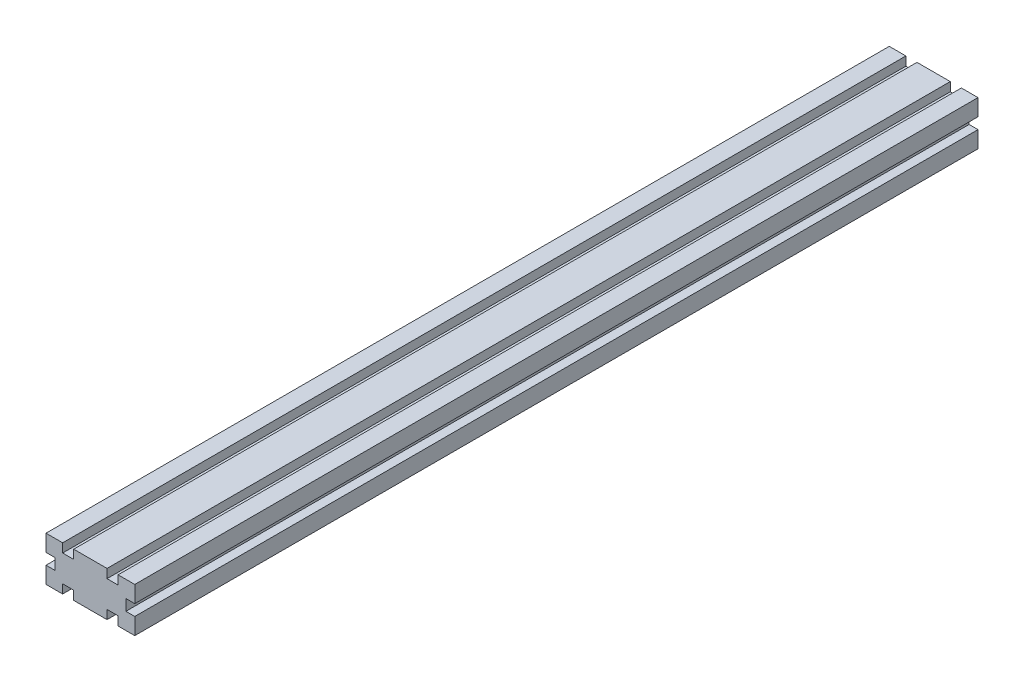
ISO-10303-21;
HEADER;
FILE_DESCRIPTION(('STEP AP214'),'2;1');
FILE_NAME('part.step','',(''),(''),'','','');
FILE_SCHEMA(('AUTOMOTIVE_DESIGN { 1 0 10303 214 1 1 1 1 }'));
ENDSEC;
DATA;
#1=APPLICATION_CONTEXT('core data for automotive mechanical design processes');
#2=APPLICATION_PROTOCOL_DEFINITION('international standard','automotive_design',2000,#1);
#3=PRODUCT_CONTEXT('',#1,'mechanical');
#4=PRODUCT('Part','Part','',(#3));
#5=PRODUCT_RELATED_PRODUCT_CATEGORY('part','',(#4));
#6=PRODUCT_DEFINITION_FORMATION('','',#4);
#7=PRODUCT_DEFINITION_CONTEXT('part definition',#1,'design');
#8=PRODUCT_DEFINITION('design','',#6,#7);
#9=PRODUCT_DEFINITION_SHAPE('','',#8);
#10=(LENGTH_UNIT() NAMED_UNIT(*) SI_UNIT(.MILLI.,.METRE.));
#11=(NAMED_UNIT(*) PLANE_ANGLE_UNIT() SI_UNIT($,.RADIAN.));
#12=(NAMED_UNIT(*) SI_UNIT($,.STERADIAN.) SOLID_ANGLE_UNIT());
#13=UNCERTAINTY_MEASURE_WITH_UNIT(LENGTH_MEASURE(1.E-05),#10,'distance_accuracy_value','');
#14=(GEOMETRIC_REPRESENTATION_CONTEXT(3) GLOBAL_UNCERTAINTY_ASSIGNED_CONTEXT((#13)) GLOBAL_UNIT_ASSIGNED_CONTEXT((#10,
#11,#12)) REPRESENTATION_CONTEXT('',''));
#15=CARTESIAN_POINT('',(0.,0.,0.));
#16=DIRECTION('',(0.,0.,1.));
#17=DIRECTION('',(1.,0.,0.));
#18=AXIS2_PLACEMENT_3D('',#15,#16,#17);
#19=CARTESIAN_POINT('',(40.,0.,380.));
#20=DIRECTION('',(-1.,0.,0.));
#21=DIRECTION('',(0.,0.,1.));
#22=AXIS2_PLACEMENT_3D('',#19,#20,#21);
#23=PLANE('',#22);
#24=DIRECTION('',(0.,1.,0.));
#25=VECTOR('',#24,1.);
#26=CARTESIAN_POINT('',(40.,0.,0.));
#27=LINE('',#26,#25);
#28=CARTESIAN_POINT('',(40.,12.5,0.));
#29=VERTEX_POINT('',#28);
#30=CARTESIAN_POINT('',(40.,20.,0.));
#31=VERTEX_POINT('',#30);
#32=EDGE_CURVE('E252',#29,#31,#27,.T.);
#33=ORIENTED_EDGE('',*,*,#32,.T.);
#34=DIRECTION('',(0.,0.,-1.));
#35=VECTOR('',#34,1.);
#36=CARTESIAN_POINT('',(40.,20.,380.));
#37=LINE('',#36,#35);
#38=CARTESIAN_POINT('',(40.,20.,380.));
#39=VERTEX_POINT('',#38);
#40=EDGE_CURVE('E11',#39,#31,#37,.T.);
#41=ORIENTED_EDGE('',*,*,#40,.F.);
#42=DIRECTION('',(0.,1.,0.));
#43=VECTOR('',#42,1.);
#44=CARTESIAN_POINT('',(40.,0.,380.));
#45=LINE('',#44,#43);
#46=CARTESIAN_POINT('',(40.,12.5,380.));
#47=VERTEX_POINT('',#46);
#48=EDGE_CURVE('E151',#47,#39,#45,.T.);
#49=ORIENTED_EDGE('',*,*,#48,.F.);
#50=DIRECTION('',(0.,0.,-1.));
#51=VECTOR('',#50,1.);
#52=CARTESIAN_POINT('',(40.,12.5,380.));
#53=LINE('',#52,#51);
#54=EDGE_CURVE('E251',#47,#29,#53,.T.);
#55=ORIENTED_EDGE('',*,*,#54,.T.);
#56=EDGE_LOOP('',(#33,#41,#49,#55));
#57=FACE_BOUND('',#56,.T.);
#58=ADVANCED_FACE('F36',(#57),#23,.F.);
#59=CARTESIAN_POINT('',(0.,20.,380.));
#60=DIRECTION('',(0.,1.,0.));
#61=DIRECTION('',(0.,0.,1.));
#62=AXIS2_PLACEMENT_3D('',#59,#60,#61);
#63=PLANE('',#62);
#64=DIRECTION('',(1.,0.,0.));
#65=VECTOR('',#64,1.);
#66=CARTESIAN_POINT('',(0.,20.,0.));
#67=LINE('',#66,#65);
#68=CARTESIAN_POINT('',(32.5,20.,0.));
#69=VERTEX_POINT('',#68);
#70=EDGE_CURVE('E255',#69,#31,#67,.T.);
#71=ORIENTED_EDGE('',*,*,#70,.F.);
#72=DIRECTION('',(0.,0.,-1.));
#73=VECTOR('',#72,1.);
#74=CARTESIAN_POINT('',(32.5,20.,380.));
#75=LINE('',#74,#73);
#76=CARTESIAN_POINT('',(32.5,20.,380.));
#77=VERTEX_POINT('',#76);
#78=EDGE_CURVE('E44',#77,#69,#75,.T.);
#79=ORIENTED_EDGE('',*,*,#78,.F.);
#80=DIRECTION('',(1.,0.,0.));
#81=VECTOR('',#80,1.);
#82=CARTESIAN_POINT('',(0.,20.,380.));
#83=LINE('',#82,#81);
#84=EDGE_CURVE('E397',#77,#39,#83,.T.);
#85=ORIENTED_EDGE('',*,*,#84,.T.);
#86=ORIENTED_EDGE('',*,*,#40,.T.);
#87=EDGE_LOOP('',(#71,#79,#85,#86));
#88=FACE_BOUND('',#87,.T.);
#89=ADVANCED_FACE('F385',(#88),#63,.T.);
#90=CARTESIAN_POINT('',(32.5,0.,380.));
#91=DIRECTION('',(-1.,0.,0.));
#92=DIRECTION('',(0.,0.,1.));
#93=AXIS2_PLACEMENT_3D('',#90,#91,#92);
#94=PLANE('',#93);
#95=DIRECTION('',(0.,1.,0.));
#96=VECTOR('',#95,1.);
#97=CARTESIAN_POINT('',(32.5,0.,0.));
#98=LINE('',#97,#96);
#99=CARTESIAN_POINT('',(32.5,16.,0.));
#100=VERTEX_POINT('',#99);
#101=EDGE_CURVE('E258',#100,#69,#98,.T.);
#102=ORIENTED_EDGE('',*,*,#101,.F.);
#103=DIRECTION('',(0.,0.,-1.));
#104=VECTOR('',#103,1.);
#105=CARTESIAN_POINT('',(32.5,16.,380.));
#106=LINE('',#105,#104);
#107=CARTESIAN_POINT('',(32.5,16.,380.));
#108=VERTEX_POINT('',#107);
#109=EDGE_CURVE('E375',#108,#100,#106,.T.);
#110=ORIENTED_EDGE('',*,*,#109,.F.);
#111=DIRECTION('',(0.,1.,0.));
#112=VECTOR('',#111,1.);
#113=CARTESIAN_POINT('',(32.5,0.,380.));
#114=LINE('',#113,#112);
#115=EDGE_CURVE('E382',#108,#77,#114,.T.);
#116=ORIENTED_EDGE('',*,*,#115,.T.);
#117=ORIENTED_EDGE('',*,*,#78,.T.);
#118=EDGE_LOOP('',(#102,#110,#116,#117));
#119=FACE_BOUND('',#118,.T.);
#120=ADVANCED_FACE('F380',(#119),#94,.T.);
#121=CARTESIAN_POINT('',(0.,16.,380.));
#122=DIRECTION('',(0.,1.,0.));
#123=DIRECTION('',(0.,0.,1.));
#124=AXIS2_PLACEMENT_3D('',#121,#122,#123);
#125=PLANE('',#124);
#126=DIRECTION('',(1.,0.,0.));
#127=VECTOR('',#126,1.);
#128=CARTESIAN_POINT('',(0.,16.,0.));
#129=LINE('',#128,#127);
#130=CARTESIAN_POINT('',(27.5,16.,0.));
#131=VERTEX_POINT('',#130);
#132=EDGE_CURVE('E261',#131,#100,#129,.T.);
#133=ORIENTED_EDGE('',*,*,#132,.F.);
#134=DIRECTION('',(0.,0.,-1.));
#135=VECTOR('',#134,1.);
#136=CARTESIAN_POINT('',(27.5,16.,380.));
#137=LINE('',#136,#135);
#138=CARTESIAN_POINT('',(27.5,16.,380.));
#139=VERTEX_POINT('',#138);
#140=EDGE_CURVE('E373',#139,#131,#137,.T.);
#141=ORIENTED_EDGE('',*,*,#140,.F.);
#142=DIRECTION('',(1.,0.,0.));
#143=VECTOR('',#142,1.);
#144=CARTESIAN_POINT('',(0.,16.,380.));
#145=LINE('',#144,#143);
#146=EDGE_CURVE('E396',#139,#108,#145,.T.);
#147=ORIENTED_EDGE('',*,*,#146,.T.);
#148=ORIENTED_EDGE('',*,*,#109,.T.);
#149=EDGE_LOOP('',(#133,#141,#147,#148));
#150=FACE_BOUND('',#149,.T.);
#151=ADVANCED_FACE('F392',(#150),#125,.T.);
#152=CARTESIAN_POINT('',(27.5,0.,380.));
#153=DIRECTION('',(-1.,0.,0.));
#154=DIRECTION('',(0.,0.,1.));
#155=AXIS2_PLACEMENT_3D('',#152,#153,#154);
#156=PLANE('',#155);
#157=DIRECTION('',(0.,1.,0.));
#158=VECTOR('',#157,1.);
#159=CARTESIAN_POINT('',(27.5,0.,0.));
#160=LINE('',#159,#158);
#161=CARTESIAN_POINT('',(27.5,20.,0.));
#162=VERTEX_POINT('',#161);
#163=EDGE_CURVE('E264',#131,#162,#160,.T.);
#164=ORIENTED_EDGE('',*,*,#163,.T.);
#165=DIRECTION('',(0.,0.,-1.));
#166=VECTOR('',#165,1.);
#167=CARTESIAN_POINT('',(27.5,20.,380.));
#168=LINE('',#167,#166);
#169=CARTESIAN_POINT('',(27.5,20.,380.));
#170=VERTEX_POINT('',#169);
#171=EDGE_CURVE('E371',#170,#162,#168,.T.);
#172=ORIENTED_EDGE('',*,*,#171,.F.);
#173=DIRECTION('',(0.,1.,0.));
#174=VECTOR('',#173,1.);
#175=CARTESIAN_POINT('',(27.5,0.,380.));
#176=LINE('',#175,#174);
#177=EDGE_CURVE('E399',#139,#170,#176,.T.);
#178=ORIENTED_EDGE('',*,*,#177,.F.);
#179=ORIENTED_EDGE('',*,*,#140,.T.);
#180=EDGE_LOOP('',(#164,#172,#178,#179));
#181=FACE_BOUND('',#180,.T.);
#182=ADVANCED_FACE('F481',(#181),#156,.F.);
#183=CARTESIAN_POINT('',(0.,20.,380.));
#184=DIRECTION('',(0.,1.,0.));
#185=DIRECTION('',(0.,0.,1.));
#186=AXIS2_PLACEMENT_3D('',#183,#184,#185);
#187=PLANE('',#186);
#188=DIRECTION('',(1.,0.,0.));
#189=VECTOR('',#188,1.);
#190=CARTESIAN_POINT('',(0.,20.,0.));
#191=LINE('',#190,#189);
#192=CARTESIAN_POINT('',(12.5,20.,0.));
#193=VERTEX_POINT('',#192);
#194=EDGE_CURVE('E267',#193,#162,#191,.T.);
#195=ORIENTED_EDGE('',*,*,#194,.F.);
#196=DIRECTION('',(0.,0.,-1.));
#197=VECTOR('',#196,1.);
#198=CARTESIAN_POINT('',(12.5,20.,380.));
#199=LINE('',#198,#197);
#200=CARTESIAN_POINT('',(12.5,20.,380.));
#201=VERTEX_POINT('',#200);
#202=EDGE_CURVE('E369',#201,#193,#199,.T.);
#203=ORIENTED_EDGE('',*,*,#202,.F.);
#204=DIRECTION('',(1.,0.,0.));
#205=VECTOR('',#204,1.);
#206=CARTESIAN_POINT('',(0.,20.,380.));
#207=LINE('',#206,#205);
#208=EDGE_CURVE('E405',#201,#170,#207,.T.);
#209=ORIENTED_EDGE('',*,*,#208,.T.);
#210=ORIENTED_EDGE('',*,*,#171,.T.);
#211=EDGE_LOOP('',(#195,#203,#209,#210));
#212=FACE_BOUND('',#211,.T.);
#213=ADVANCED_FACE('F484',(#212),#187,.T.);
#214=CARTESIAN_POINT('',(12.5,0.,380.));
#215=DIRECTION('',(-1.,0.,0.));
#216=DIRECTION('',(0.,0.,1.));
#217=AXIS2_PLACEMENT_3D('',#214,#215,#216);
#218=PLANE('',#217);
#219=DIRECTION('',(0.,1.,0.));
#220=VECTOR('',#219,1.);
#221=CARTESIAN_POINT('',(12.5,0.,0.));
#222=LINE('',#221,#220);
#223=CARTESIAN_POINT('',(12.5,16.,0.));
#224=VERTEX_POINT('',#223);
#225=EDGE_CURVE('E270',#224,#193,#222,.T.);
#226=ORIENTED_EDGE('',*,*,#225,.F.);
#227=DIRECTION('',(0.,0.,-1.));
#228=VECTOR('',#227,1.);
#229=CARTESIAN_POINT('',(12.5,16.,380.));
#230=LINE('',#229,#228);
#231=CARTESIAN_POINT('',(12.5,16.,380.));
#232=VERTEX_POINT('',#231);
#233=EDGE_CURVE('E367',#232,#224,#230,.T.);
#234=ORIENTED_EDGE('',*,*,#233,.F.);
#235=DIRECTION('',(0.,1.,0.));
#236=VECTOR('',#235,1.);
#237=CARTESIAN_POINT('',(12.5,0.,380.));
#238=LINE('',#237,#236);
#239=EDGE_CURVE('E408',#232,#201,#238,.T.);
#240=ORIENTED_EDGE('',*,*,#239,.T.);
#241=ORIENTED_EDGE('',*,*,#202,.T.);
#242=EDGE_LOOP('',(#226,#234,#240,#241));
#243=FACE_BOUND('',#242,.T.);
#244=ADVANCED_FACE('F488',(#243),#218,.T.);
#245=CARTESIAN_POINT('',(0.,16.,380.));
#246=DIRECTION('',(0.,1.,0.));
#247=DIRECTION('',(0.,0.,1.));
#248=AXIS2_PLACEMENT_3D('',#245,#246,#247);
#249=PLANE('',#248);
#250=DIRECTION('',(1.,0.,0.));
#251=VECTOR('',#250,1.);
#252=CARTESIAN_POINT('',(0.,16.,0.));
#253=LINE('',#252,#251);
#254=CARTESIAN_POINT('',(7.5,16.,0.));
#255=VERTEX_POINT('',#254);
#256=EDGE_CURVE('E273',#255,#224,#253,.T.);
#257=ORIENTED_EDGE('',*,*,#256,.F.);
#258=DIRECTION('',(0.,0.,-1.));
#259=VECTOR('',#258,1.);
#260=CARTESIAN_POINT('',(7.5,16.,380.));
#261=LINE('',#260,#259);
#262=CARTESIAN_POINT('',(7.5,16.,380.));
#263=VERTEX_POINT('',#262);
#264=EDGE_CURVE('E365',#263,#255,#261,.T.);
#265=ORIENTED_EDGE('',*,*,#264,.F.);
#266=DIRECTION('',(1.,0.,0.));
#267=VECTOR('',#266,1.);
#268=CARTESIAN_POINT('',(0.,16.,380.));
#269=LINE('',#268,#267);
#270=EDGE_CURVE('E411',#263,#232,#269,.T.);
#271=ORIENTED_EDGE('',*,*,#270,.T.);
#272=ORIENTED_EDGE('',*,*,#233,.T.);
#273=EDGE_LOOP('',(#257,#265,#271,#272));
#274=FACE_BOUND('',#273,.T.);
#275=ADVANCED_FACE('F492',(#274),#249,.T.);
#276=CARTESIAN_POINT('',(7.5,0.,380.));
#277=DIRECTION('',(-1.,0.,0.));
#278=DIRECTION('',(0.,0.,1.));
#279=AXIS2_PLACEMENT_3D('',#276,#277,#278);
#280=PLANE('',#279);
#281=DIRECTION('',(0.,1.,0.));
#282=VECTOR('',#281,1.);
#283=CARTESIAN_POINT('',(7.5,0.,0.));
#284=LINE('',#283,#282);
#285=CARTESIAN_POINT('',(7.5,20.,0.));
#286=VERTEX_POINT('',#285);
#287=EDGE_CURVE('E276',#255,#286,#284,.T.);
#288=ORIENTED_EDGE('',*,*,#287,.T.);
#289=DIRECTION('',(0.,0.,-1.));
#290=VECTOR('',#289,1.);
#291=CARTESIAN_POINT('',(7.5,20.,380.));
#292=LINE('',#291,#290);
#293=CARTESIAN_POINT('',(7.5,20.,380.));
#294=VERTEX_POINT('',#293);
#295=EDGE_CURVE('E363',#294,#286,#292,.T.);
#296=ORIENTED_EDGE('',*,*,#295,.F.);
#297=DIRECTION('',(0.,1.,0.));
#298=VECTOR('',#297,1.);
#299=CARTESIAN_POINT('',(7.5,0.,380.));
#300=LINE('',#299,#298);
#301=EDGE_CURVE('E414',#263,#294,#300,.T.);
#302=ORIENTED_EDGE('',*,*,#301,.F.);
#303=ORIENTED_EDGE('',*,*,#264,.T.);
#304=EDGE_LOOP('',(#288,#296,#302,#303));
#305=FACE_BOUND('',#304,.T.);
#306=ADVANCED_FACE('F496',(#305),#280,.F.);
#307=CARTESIAN_POINT('',(0.,20.,380.));
#308=DIRECTION('',(0.,1.,0.));
#309=DIRECTION('',(0.,0.,1.));
#310=AXIS2_PLACEMENT_3D('',#307,#308,#309);
#311=PLANE('',#310);
#312=DIRECTION('',(1.,0.,0.));
#313=VECTOR('',#312,1.);
#314=CARTESIAN_POINT('',(0.,20.,0.));
#315=LINE('',#314,#313);
#316=CARTESIAN_POINT('',(0.,20.,0.));
#317=VERTEX_POINT('',#316);
#318=EDGE_CURVE('E279',#317,#286,#315,.T.);
#319=ORIENTED_EDGE('',*,*,#318,.F.);
#320=DIRECTION('',(0.,0.,-1.));
#321=VECTOR('',#320,1.);
#322=CARTESIAN_POINT('',(0.,20.,380.));
#323=LINE('',#322,#321);
#324=CARTESIAN_POINT('',(0.,20.,380.));
#325=VERTEX_POINT('',#324);
#326=EDGE_CURVE('E361',#325,#317,#323,.T.);
#327=ORIENTED_EDGE('',*,*,#326,.F.);
#328=DIRECTION('',(1.,0.,0.));
#329=VECTOR('',#328,1.);
#330=CARTESIAN_POINT('',(0.,20.,380.));
#331=LINE('',#330,#329);
#332=EDGE_CURVE('E416',#325,#294,#331,.T.);
#333=ORIENTED_EDGE('',*,*,#332,.T.);
#334=ORIENTED_EDGE('',*,*,#295,.T.);
#335=EDGE_LOOP('',(#319,#327,#333,#334));
#336=FACE_BOUND('',#335,.T.);
#337=ADVANCED_FACE('F500',(#336),#311,.T.);
#338=CARTESIAN_POINT('',(0.,0.,380.));
#339=DIRECTION('',(-1.,0.,0.));
#340=DIRECTION('',(0.,0.,1.));
#341=AXIS2_PLACEMENT_3D('',#338,#339,#340);
#342=PLANE('',#341);
#343=DIRECTION('',(0.,1.,0.));
#344=VECTOR('',#343,1.);
#345=CARTESIAN_POINT('',(0.,0.,0.));
#346=LINE('',#345,#344);
#347=CARTESIAN_POINT('',(0.,12.5,0.));
#348=VERTEX_POINT('',#347);
#349=EDGE_CURVE('E282',#348,#317,#346,.T.);
#350=ORIENTED_EDGE('',*,*,#349,.F.);
#351=DIRECTION('',(0.,0.,-1.));
#352=VECTOR('',#351,1.);
#353=CARTESIAN_POINT('',(0.,12.5,380.));
#354=LINE('',#353,#352);
#355=CARTESIAN_POINT('',(0.,12.5,380.));
#356=VERTEX_POINT('',#355);
#357=EDGE_CURVE('E359',#356,#348,#354,.T.);
#358=ORIENTED_EDGE('',*,*,#357,.F.);
#359=DIRECTION('',(0.,1.,0.));
#360=VECTOR('',#359,1.);
#361=CARTESIAN_POINT('',(0.,0.,380.));
#362=LINE('',#361,#360);
#363=EDGE_CURVE('E419',#356,#325,#362,.T.);
#364=ORIENTED_EDGE('',*,*,#363,.T.);
#365=ORIENTED_EDGE('',*,*,#326,.T.);
#366=EDGE_LOOP('',(#350,#358,#364,#365));
#367=FACE_BOUND('',#366,.T.);
#368=ADVANCED_FACE('F504',(#367),#342,.T.);
#369=CARTESIAN_POINT('',(0.,12.5,380.));
#370=DIRECTION('',(0.,1.,0.));
#371=DIRECTION('',(-1.,0.,0.));
#372=AXIS2_PLACEMENT_3D('',#369,#370,#371);
#373=PLANE('',#372);
#374=DIRECTION('',(1.,0.,0.));
#375=VECTOR('',#374,1.);
#376=CARTESIAN_POINT('',(0.,12.5,0.));
#377=LINE('',#376,#375);
#378=CARTESIAN_POINT('',(4.,12.5,0.));
#379=VERTEX_POINT('',#378);
#380=EDGE_CURVE('E285',#348,#379,#377,.T.);
#381=ORIENTED_EDGE('',*,*,#380,.T.);
#382=DIRECTION('',(0.,0.,-1.));
#383=VECTOR('',#382,1.);
#384=CARTESIAN_POINT('',(4.,12.5,380.));
#385=LINE('',#384,#383);
#386=CARTESIAN_POINT('',(4.,12.5,380.));
#387=VERTEX_POINT('',#386);
#388=EDGE_CURVE('E357',#387,#379,#385,.T.);
#389=ORIENTED_EDGE('',*,*,#388,.F.);
#390=DIRECTION('',(1.,0.,0.));
#391=VECTOR('',#390,1.);
#392=CARTESIAN_POINT('',(0.,12.5,380.));
#393=LINE('',#392,#391);
#394=EDGE_CURVE('E422',#356,#387,#393,.T.);
#395=ORIENTED_EDGE('',*,*,#394,.F.);
#396=ORIENTED_EDGE('',*,*,#357,.T.);
#397=EDGE_LOOP('',(#381,#389,#395,#396));
#398=FACE_BOUND('',#397,.T.);
#399=ADVANCED_FACE('F508',(#398),#373,.F.);
#400=CARTESIAN_POINT('',(4.,0.,380.));
#401=DIRECTION('',(-1.,0.,0.));
#402=DIRECTION('',(0.,0.,1.));
#403=AXIS2_PLACEMENT_3D('',#400,#401,#402);
#404=PLANE('',#403);
#405=DIRECTION('',(0.,1.,0.));
#406=VECTOR('',#405,1.);
#407=CARTESIAN_POINT('',(4.,0.,0.));
#408=LINE('',#407,#406);
#409=CARTESIAN_POINT('',(4.,7.5,0.));
#410=VERTEX_POINT('',#409);
#411=EDGE_CURVE('E288',#410,#379,#408,.T.);
#412=ORIENTED_EDGE('',*,*,#411,.F.);
#413=DIRECTION('',(0.,0.,-1.));
#414=VECTOR('',#413,1.);
#415=CARTESIAN_POINT('',(4.,7.5,380.));
#416=LINE('',#415,#414);
#417=CARTESIAN_POINT('',(4.,7.5,380.));
#418=VERTEX_POINT('',#417);
#419=EDGE_CURVE('E355',#418,#410,#416,.T.);
#420=ORIENTED_EDGE('',*,*,#419,.F.);
#421=DIRECTION('',(0.,1.,0.));
#422=VECTOR('',#421,1.);
#423=CARTESIAN_POINT('',(4.,0.,380.));
#424=LINE('',#423,#422);
#425=EDGE_CURVE('E424',#418,#387,#424,.T.);
#426=ORIENTED_EDGE('',*,*,#425,.T.);
#427=ORIENTED_EDGE('',*,*,#388,.T.);
#428=EDGE_LOOP('',(#412,#420,#426,#427));
#429=FACE_BOUND('',#428,.T.);
#430=ADVANCED_FACE('F512',(#429),#404,.T.);
#431=CARTESIAN_POINT('',(0.,7.5,380.));
#432=DIRECTION('',(0.,1.,0.));
#433=DIRECTION('',(-1.,0.,0.));
#434=AXIS2_PLACEMENT_3D('',#431,#432,#433);
#435=PLANE('',#434);
#436=DIRECTION('',(1.,0.,0.));
#437=VECTOR('',#436,1.);
#438=CARTESIAN_POINT('',(0.,7.5,0.));
#439=LINE('',#438,#437);
#440=CARTESIAN_POINT('',(0.,7.5,0.));
#441=VERTEX_POINT('',#440);
#442=EDGE_CURVE('E291',#441,#410,#439,.T.);
#443=ORIENTED_EDGE('',*,*,#442,.F.);
#444=DIRECTION('',(0.,0.,-1.));
#445=VECTOR('',#444,1.);
#446=CARTESIAN_POINT('',(0.,7.5,380.));
#447=LINE('',#446,#445);
#448=CARTESIAN_POINT('',(0.,7.5,380.));
#449=VERTEX_POINT('',#448);
#450=EDGE_CURVE('E353',#449,#441,#447,.T.);
#451=ORIENTED_EDGE('',*,*,#450,.F.);
#452=DIRECTION('',(1.,0.,0.));
#453=VECTOR('',#452,1.);
#454=CARTESIAN_POINT('',(0.,7.5,380.));
#455=LINE('',#454,#453);
#456=EDGE_CURVE('E427',#449,#418,#455,.T.);
#457=ORIENTED_EDGE('',*,*,#456,.T.);
#458=ORIENTED_EDGE('',*,*,#419,.T.);
#459=EDGE_LOOP('',(#443,#451,#457,#458));
#460=FACE_BOUND('',#459,.T.);
#461=ADVANCED_FACE('F516',(#460),#435,.T.);
#462=CARTESIAN_POINT('',(0.,0.,380.));
#463=DIRECTION('',(-1.,0.,0.));
#464=DIRECTION('',(0.,0.,1.));
#465=AXIS2_PLACEMENT_3D('',#462,#463,#464);
#466=PLANE('',#465);
#467=DIRECTION('',(0.,1.,0.));
#468=VECTOR('',#467,1.);
#469=CARTESIAN_POINT('',(0.,0.,0.));
#470=LINE('',#469,#468);
#471=CARTESIAN_POINT('',(0.,0.,0.));
#472=VERTEX_POINT('',#471);
#473=EDGE_CURVE('E294',#472,#441,#470,.T.);
#474=ORIENTED_EDGE('',*,*,#473,.F.);
#475=DIRECTION('',(0.,0.,-1.));
#476=VECTOR('',#475,1.);
#477=CARTESIAN_POINT('',(0.,0.,380.));
#478=LINE('',#477,#476);
#479=CARTESIAN_POINT('',(0.,0.,380.));
#480=VERTEX_POINT('',#479);
#481=EDGE_CURVE('E351',#480,#472,#478,.T.);
#482=ORIENTED_EDGE('',*,*,#481,.F.);
#483=DIRECTION('',(0.,1.,0.));
#484=VECTOR('',#483,1.);
#485=CARTESIAN_POINT('',(0.,0.,380.));
#486=LINE('',#485,#484);
#487=EDGE_CURVE('E430',#480,#449,#486,.T.);
#488=ORIENTED_EDGE('',*,*,#487,.T.);
#489=ORIENTED_EDGE('',*,*,#450,.T.);
#490=EDGE_LOOP('',(#474,#482,#488,#489));
#491=FACE_BOUND('',#490,.T.);
#492=ADVANCED_FACE('F520',(#491),#466,.T.);
#493=CARTESIAN_POINT('',(0.,0.,380.));
#494=DIRECTION('',(0.,1.,0.));
#495=DIRECTION('',(0.,0.,1.));
#496=AXIS2_PLACEMENT_3D('',#493,#494,#495);
#497=PLANE('',#496);
#498=DIRECTION('',(1.,0.,0.));
#499=VECTOR('',#498,1.);
#500=CARTESIAN_POINT('',(0.,0.,0.));
#501=LINE('',#500,#499);
#502=CARTESIAN_POINT('',(7.5,0.,0.));
#503=VERTEX_POINT('',#502);
#504=EDGE_CURVE('E297',#472,#503,#501,.T.);
#505=ORIENTED_EDGE('',*,*,#504,.T.);
#506=DIRECTION('',(0.,0.,-1.));
#507=VECTOR('',#506,1.);
#508=CARTESIAN_POINT('',(7.5,0.,380.));
#509=LINE('',#508,#507);
#510=CARTESIAN_POINT('',(7.5,0.,380.));
#511=VERTEX_POINT('',#510);
#512=EDGE_CURVE('E348',#511,#503,#509,.T.);
#513=ORIENTED_EDGE('',*,*,#512,.F.);
#514=DIRECTION('',(1.,0.,0.));
#515=VECTOR('',#514,1.);
#516=CARTESIAN_POINT('',(0.,0.,380.));
#517=LINE('',#516,#515);
#518=EDGE_CURVE('E433',#480,#511,#517,.T.);
#519=ORIENTED_EDGE('',*,*,#518,.F.);
#520=ORIENTED_EDGE('',*,*,#481,.T.);
#521=EDGE_LOOP('',(#505,#513,#519,#520));
#522=FACE_BOUND('',#521,.T.);
#523=ADVANCED_FACE('F524',(#522),#497,.F.);
#524=CARTESIAN_POINT('',(7.5,0.,380.));
#525=DIRECTION('',(-1.,0.,0.));
#526=DIRECTION('',(0.,0.,1.));
#527=AXIS2_PLACEMENT_3D('',#524,#525,#526);
#528=PLANE('',#527);
#529=DIRECTION('',(0.,1.,0.));
#530=VECTOR('',#529,1.);
#531=CARTESIAN_POINT('',(7.5,0.,0.));
#532=LINE('',#531,#530);
#533=CARTESIAN_POINT('',(7.5,4.,0.));
#534=VERTEX_POINT('',#533);
#535=EDGE_CURVE('E299',#503,#534,#532,.T.);
#536=ORIENTED_EDGE('',*,*,#535,.T.);
#537=DIRECTION('',(0.,0.,-1.));
#538=VECTOR('',#537,1.);
#539=CARTESIAN_POINT('',(7.5,4.,380.));
#540=LINE('',#539,#538);
#541=CARTESIAN_POINT('',(7.5,4.,380.));
#542=VERTEX_POINT('',#541);
#543=EDGE_CURVE('E345',#542,#534,#540,.T.);
#544=ORIENTED_EDGE('',*,*,#543,.F.);
#545=DIRECTION('',(0.,1.,0.));
#546=VECTOR('',#545,1.);
#547=CARTESIAN_POINT('',(7.5,0.,380.));
#548=LINE('',#547,#546);
#549=EDGE_CURVE('E435',#511,#542,#548,.T.);
#550=ORIENTED_EDGE('',*,*,#549,.F.);
#551=ORIENTED_EDGE('',*,*,#512,.T.);
#552=EDGE_LOOP('',(#536,#544,#550,#551));
#553=FACE_BOUND('',#552,.T.);
#554=ADVANCED_FACE('F528',(#553),#528,.F.);
#555=CARTESIAN_POINT('',(0.,4.,380.));
#556=DIRECTION('',(0.,1.,0.));
#557=DIRECTION('',(0.,0.,1.));
#558=AXIS2_PLACEMENT_3D('',#555,#556,#557);
#559=PLANE('',#558);
#560=DIRECTION('',(1.,0.,0.));
#561=VECTOR('',#560,1.);
#562=CARTESIAN_POINT('',(0.,4.,0.));
#563=LINE('',#562,#561);
#564=CARTESIAN_POINT('',(12.5,4.,0.));
#565=VERTEX_POINT('',#564);
#566=EDGE_CURVE('E301',#534,#565,#563,.T.);
#567=ORIENTED_EDGE('',*,*,#566,.T.);
#568=DIRECTION('',(0.,0.,-1.));
#569=VECTOR('',#568,1.);
#570=CARTESIAN_POINT('',(12.5,4.,380.));
#571=LINE('',#570,#569);
#572=CARTESIAN_POINT('',(12.5,4.,380.));
#573=VERTEX_POINT('',#572);
#574=EDGE_CURVE('E343',#573,#565,#571,.T.);
#575=ORIENTED_EDGE('',*,*,#574,.F.);
#576=DIRECTION('',(1.,0.,0.));
#577=VECTOR('',#576,1.);
#578=CARTESIAN_POINT('',(0.,4.,380.));
#579=LINE('',#578,#577);
#580=EDGE_CURVE('E437',#542,#573,#579,.T.);
#581=ORIENTED_EDGE('',*,*,#580,.F.);
#582=ORIENTED_EDGE('',*,*,#543,.T.);
#583=EDGE_LOOP('',(#567,#575,#581,#582));
#584=FACE_BOUND('',#583,.T.);
#585=ADVANCED_FACE('F532',(#584),#559,.F.);
#586=CARTESIAN_POINT('',(12.5,0.,380.));
#587=DIRECTION('',(-1.,0.,0.));
#588=DIRECTION('',(0.,0.,1.));
#589=AXIS2_PLACEMENT_3D('',#586,#587,#588);
#590=PLANE('',#589);
#591=DIRECTION('',(0.,1.,0.));
#592=VECTOR('',#591,1.);
#593=CARTESIAN_POINT('',(12.5,0.,0.));
#594=LINE('',#593,#592);
#595=CARTESIAN_POINT('',(12.5,0.,0.));
#596=VERTEX_POINT('',#595);
#597=EDGE_CURVE('E304',#596,#565,#594,.T.);
#598=ORIENTED_EDGE('',*,*,#597,.F.);
#599=DIRECTION('',(0.,0.,-1.));
#600=VECTOR('',#599,1.);
#601=CARTESIAN_POINT('',(12.5,0.,380.));
#602=LINE('',#601,#600);
#603=CARTESIAN_POINT('',(12.5,0.,380.));
#604=VERTEX_POINT('',#603);
#605=EDGE_CURVE('E341',#604,#596,#602,.T.);
#606=ORIENTED_EDGE('',*,*,#605,.F.);
#607=DIRECTION('',(0.,1.,0.));
#608=VECTOR('',#607,1.);
#609=CARTESIAN_POINT('',(12.5,0.,380.));
#610=LINE('',#609,#608);
#611=EDGE_CURVE('E439',#604,#573,#610,.T.);
#612=ORIENTED_EDGE('',*,*,#611,.T.);
#613=ORIENTED_EDGE('',*,*,#574,.T.);
#614=EDGE_LOOP('',(#598,#606,#612,#613));
#615=FACE_BOUND('',#614,.T.);
#616=ADVANCED_FACE('F536',(#615),#590,.T.);
#617=CARTESIAN_POINT('',(0.,0.,380.));
#618=DIRECTION('',(0.,1.,0.));
#619=DIRECTION('',(0.,0.,1.));
#620=AXIS2_PLACEMENT_3D('',#617,#618,#619);
#621=PLANE('',#620);
#622=DIRECTION('',(1.,0.,0.));
#623=VECTOR('',#622,1.);
#624=CARTESIAN_POINT('',(0.,0.,0.));
#625=LINE('',#624,#623);
#626=CARTESIAN_POINT('',(27.5,0.,0.));
#627=VERTEX_POINT('',#626);
#628=EDGE_CURVE('E307',#596,#627,#625,.T.);
#629=ORIENTED_EDGE('',*,*,#628,.T.);
#630=DIRECTION('',(0.,0.,-1.));
#631=VECTOR('',#630,1.);
#632=CARTESIAN_POINT('',(27.5,0.,380.));
#633=LINE('',#632,#631);
#634=CARTESIAN_POINT('',(27.5,0.,380.));
#635=VERTEX_POINT('',#634);
#636=EDGE_CURVE('E338',#635,#627,#633,.T.);
#637=ORIENTED_EDGE('',*,*,#636,.F.);
#638=DIRECTION('',(1.,0.,0.));
#639=VECTOR('',#638,1.);
#640=CARTESIAN_POINT('',(0.,0.,380.));
#641=LINE('',#640,#639);
#642=EDGE_CURVE('E442',#604,#635,#641,.T.);
#643=ORIENTED_EDGE('',*,*,#642,.F.);
#644=ORIENTED_EDGE('',*,*,#605,.T.);
#645=EDGE_LOOP('',(#629,#637,#643,#644));
#646=FACE_BOUND('',#645,.T.);
#647=ADVANCED_FACE('F540',(#646),#621,.F.);
#648=CARTESIAN_POINT('',(27.5,0.,380.));
#649=DIRECTION('',(-1.,0.,0.));
#650=DIRECTION('',(0.,0.,1.));
#651=AXIS2_PLACEMENT_3D('',#648,#649,#650);
#652=PLANE('',#651);
#653=DIRECTION('',(0.,1.,0.));
#654=VECTOR('',#653,1.);
#655=CARTESIAN_POINT('',(27.5,0.,0.));
#656=LINE('',#655,#654);
#657=CARTESIAN_POINT('',(27.5,3.99999999999999,0.));
#658=VERTEX_POINT('',#657);
#659=EDGE_CURVE('E309',#627,#658,#656,.T.);
#660=ORIENTED_EDGE('',*,*,#659,.T.);
#661=DIRECTION('',(0.,0.,-1.));
#662=VECTOR('',#661,1.);
#663=CARTESIAN_POINT('',(27.5,3.99999999999999,380.));
#664=LINE('',#663,#662);
#665=CARTESIAN_POINT('',(27.5,3.99999999999999,380.));
#666=VERTEX_POINT('',#665);
#667=EDGE_CURVE('E335',#666,#658,#664,.T.);
#668=ORIENTED_EDGE('',*,*,#667,.F.);
#669=DIRECTION('',(0.,1.,0.));
#670=VECTOR('',#669,1.);
#671=CARTESIAN_POINT('',(27.5,0.,380.));
#672=LINE('',#671,#670);
#673=EDGE_CURVE('E444',#635,#666,#672,.T.);
#674=ORIENTED_EDGE('',*,*,#673,.F.);
#675=ORIENTED_EDGE('',*,*,#636,.T.);
#676=EDGE_LOOP('',(#660,#668,#674,#675));
#677=FACE_BOUND('',#676,.T.);
#678=ADVANCED_FACE('F544',(#677),#652,.F.);
#679=CARTESIAN_POINT('',(0.,3.99999999999999,380.));
#680=DIRECTION('',(0.,1.,0.));
#681=DIRECTION('',(0.,0.,1.));
#682=AXIS2_PLACEMENT_3D('',#679,#680,#681);
#683=PLANE('',#682);
#684=DIRECTION('',(1.,0.,0.));
#685=VECTOR('',#684,1.);
#686=CARTESIAN_POINT('',(0.,3.99999999999999,0.));
#687=LINE('',#686,#685);
#688=CARTESIAN_POINT('',(32.5,3.99999999999999,0.));
#689=VERTEX_POINT('',#688);
#690=EDGE_CURVE('E311',#658,#689,#687,.T.);
#691=ORIENTED_EDGE('',*,*,#690,.T.);
#692=DIRECTION('',(0.,0.,-1.));
#693=VECTOR('',#692,1.);
#694=CARTESIAN_POINT('',(32.5,3.99999999999999,380.));
#695=LINE('',#694,#693);
#696=CARTESIAN_POINT('',(32.5,3.99999999999999,380.));
#697=VERTEX_POINT('',#696);
#698=EDGE_CURVE('E333',#697,#689,#695,.T.);
#699=ORIENTED_EDGE('',*,*,#698,.F.);
#700=DIRECTION('',(1.,0.,0.));
#701=VECTOR('',#700,1.);
#702=CARTESIAN_POINT('',(0.,3.99999999999999,380.));
#703=LINE('',#702,#701);
#704=EDGE_CURVE('E446',#666,#697,#703,.T.);
#705=ORIENTED_EDGE('',*,*,#704,.F.);
#706=ORIENTED_EDGE('',*,*,#667,.T.);
#707=EDGE_LOOP('',(#691,#699,#705,#706));
#708=FACE_BOUND('',#707,.T.);
#709=ADVANCED_FACE('F548',(#708),#683,.F.);
#710=CARTESIAN_POINT('',(32.5,0.,380.));
#711=DIRECTION('',(-1.,0.,0.));
#712=DIRECTION('',(0.,0.,1.));
#713=AXIS2_PLACEMENT_3D('',#710,#711,#712);
#714=PLANE('',#713);
#715=DIRECTION('',(0.,1.,0.));
#716=VECTOR('',#715,1.);
#717=CARTESIAN_POINT('',(32.5,0.,0.));
#718=LINE('',#717,#716);
#719=CARTESIAN_POINT('',(32.5,0.,0.));
#720=VERTEX_POINT('',#719);
#721=EDGE_CURVE('E314',#720,#689,#718,.T.);
#722=ORIENTED_EDGE('',*,*,#721,.F.);
#723=DIRECTION('',(0.,0.,-1.));
#724=VECTOR('',#723,1.);
#725=CARTESIAN_POINT('',(32.5,0.,380.));
#726=LINE('',#725,#724);
#727=CARTESIAN_POINT('',(32.5,0.,380.));
#728=VERTEX_POINT('',#727);
#729=EDGE_CURVE('E331',#728,#720,#726,.T.);
#730=ORIENTED_EDGE('',*,*,#729,.F.);
#731=DIRECTION('',(0.,1.,0.));
#732=VECTOR('',#731,1.);
#733=CARTESIAN_POINT('',(32.5,0.,380.));
#734=LINE('',#733,#732);
#735=EDGE_CURVE('E448',#728,#697,#734,.T.);
#736=ORIENTED_EDGE('',*,*,#735,.T.);
#737=ORIENTED_EDGE('',*,*,#698,.T.);
#738=EDGE_LOOP('',(#722,#730,#736,#737));
#739=FACE_BOUND('',#738,.T.);
#740=ADVANCED_FACE('F552',(#739),#714,.T.);
#741=CARTESIAN_POINT('',(0.,0.,380.));
#742=DIRECTION('',(0.,1.,0.));
#743=DIRECTION('',(0.,0.,1.));
#744=AXIS2_PLACEMENT_3D('',#741,#742,#743);
#745=PLANE('',#744);
#746=DIRECTION('',(1.,0.,0.));
#747=VECTOR('',#746,1.);
#748=CARTESIAN_POINT('',(0.,0.,0.));
#749=LINE('',#748,#747);
#750=CARTESIAN_POINT('',(40.,0.,0.));
#751=VERTEX_POINT('',#750);
#752=EDGE_CURVE('E317',#720,#751,#749,.T.);
#753=ORIENTED_EDGE('',*,*,#752,.T.);
#754=DIRECTION('',(0.,0.,-1.));
#755=VECTOR('',#754,1.);
#756=CARTESIAN_POINT('',(40.,0.,380.));
#757=LINE('',#756,#755);
#758=CARTESIAN_POINT('',(40.,0.,380.));
#759=VERTEX_POINT('',#758);
#760=EDGE_CURVE('E328',#759,#751,#757,.T.);
#761=ORIENTED_EDGE('',*,*,#760,.F.);
#762=DIRECTION('',(1.,0.,0.));
#763=VECTOR('',#762,1.);
#764=CARTESIAN_POINT('',(0.,0.,380.));
#765=LINE('',#764,#763);
#766=EDGE_CURVE('E246',#728,#759,#765,.T.);
#767=ORIENTED_EDGE('',*,*,#766,.F.);
#768=ORIENTED_EDGE('',*,*,#729,.T.);
#769=EDGE_LOOP('',(#753,#761,#767,#768));
#770=FACE_BOUND('',#769,.T.);
#771=ADVANCED_FACE('F454',(#770),#745,.F.);
#772=CARTESIAN_POINT('',(40.,0.,380.));
#773=DIRECTION('',(-1.,0.,0.));
#774=DIRECTION('',(0.,0.,1.));
#775=AXIS2_PLACEMENT_3D('',#772,#773,#774);
#776=PLANE('',#775);
#777=DIRECTION('',(0.,1.,0.));
#778=VECTOR('',#777,1.);
#779=CARTESIAN_POINT('',(40.,0.,0.));
#780=LINE('',#779,#778);
#781=CARTESIAN_POINT('',(40.,7.5,0.));
#782=VERTEX_POINT('',#781);
#783=EDGE_CURVE('E319',#751,#782,#780,.T.);
#784=ORIENTED_EDGE('',*,*,#783,.T.);
#785=DIRECTION('',(0.,0.,-1.));
#786=VECTOR('',#785,1.);
#787=CARTESIAN_POINT('',(40.,7.5,380.));
#788=LINE('',#787,#786);
#789=CARTESIAN_POINT('',(40.,7.5,380.));
#790=VERTEX_POINT('',#789);
#791=EDGE_CURVE('E235',#790,#782,#788,.T.);
#792=ORIENTED_EDGE('',*,*,#791,.F.);
#793=DIRECTION('',(0.,1.,0.));
#794=VECTOR('',#793,1.);
#795=CARTESIAN_POINT('',(40.,0.,380.));
#796=LINE('',#795,#794);
#797=EDGE_CURVE('E243',#759,#790,#796,.T.);
#798=ORIENTED_EDGE('',*,*,#797,.F.);
#799=ORIENTED_EDGE('',*,*,#760,.T.);
#800=EDGE_LOOP('',(#784,#792,#798,#799));
#801=FACE_BOUND('',#800,.T.);
#802=ADVANCED_FACE('F458',(#801),#776,.F.);
#803=CARTESIAN_POINT('',(0.,7.5,380.));
#804=DIRECTION('',(0.,1.,0.));
#805=DIRECTION('',(-1.,0.,0.));
#806=AXIS2_PLACEMENT_3D('',#803,#804,#805);
#807=PLANE('',#806);
#808=DIRECTION('',(1.,0.,0.));
#809=VECTOR('',#808,1.);
#810=CARTESIAN_POINT('',(0.,7.5,0.));
#811=LINE('',#810,#809);
#812=CARTESIAN_POINT('',(36.,7.5,0.));
#813=VERTEX_POINT('',#812);
#814=EDGE_CURVE('E234',#813,#782,#811,.T.);
#815=ORIENTED_EDGE('',*,*,#814,.F.);
#816=DIRECTION('',(0.,0.,-1.));
#817=VECTOR('',#816,1.);
#818=CARTESIAN_POINT('',(36.,7.5,380.));
#819=LINE('',#818,#817);
#820=CARTESIAN_POINT('',(36.,7.5,380.));
#821=VERTEX_POINT('',#820);
#822=EDGE_CURVE('E228',#821,#813,#819,.T.);
#823=ORIENTED_EDGE('',*,*,#822,.F.);
#824=DIRECTION('',(1.,0.,0.));
#825=VECTOR('',#824,1.);
#826=CARTESIAN_POINT('',(0.,7.5,380.));
#827=LINE('',#826,#825);
#828=EDGE_CURVE('E232',#821,#790,#827,.T.);
#829=ORIENTED_EDGE('',*,*,#828,.T.);
#830=ORIENTED_EDGE('',*,*,#791,.T.);
#831=EDGE_LOOP('',(#815,#823,#829,#830));
#832=FACE_BOUND('',#831,.T.);
#833=ADVANCED_FACE('F230',(#832),#807,.T.);
#834=CARTESIAN_POINT('',(36.,0.,380.));
#835=DIRECTION('',(-1.,0.,0.));
#836=DIRECTION('',(0.,0.,1.));
#837=AXIS2_PLACEMENT_3D('',#834,#835,#836);
#838=PLANE('',#837);
#839=DIRECTION('',(0.,1.,0.));
#840=VECTOR('',#839,1.);
#841=CARTESIAN_POINT('',(36.,0.,0.));
#842=LINE('',#841,#840);
#843=CARTESIAN_POINT('',(36.,12.5,0.));
#844=VERTEX_POINT('',#843);
#845=EDGE_CURVE('E139',#813,#844,#842,.T.);
#846=ORIENTED_EDGE('',*,*,#845,.T.);
#847=DIRECTION('',(0.,0.,-1.));
#848=VECTOR('',#847,1.);
#849=CARTESIAN_POINT('',(36.,12.5,380.));
#850=LINE('',#849,#848);
#851=CARTESIAN_POINT('',(36.,12.5,380.));
#852=VERTEX_POINT('',#851);
#853=EDGE_CURVE('E236',#852,#844,#850,.T.);
#854=ORIENTED_EDGE('',*,*,#853,.F.);
#855=DIRECTION('',(0.,1.,0.));
#856=VECTOR('',#855,1.);
#857=CARTESIAN_POINT('',(36.,0.,380.));
#858=LINE('',#857,#856);
#859=EDGE_CURVE('E238',#821,#852,#858,.T.);
#860=ORIENTED_EDGE('',*,*,#859,.F.);
#861=ORIENTED_EDGE('',*,*,#822,.T.);
#862=EDGE_LOOP('',(#846,#854,#860,#861));
#863=FACE_BOUND('',#862,.T.);
#864=ADVANCED_FACE('F239',(#863),#838,.F.);
#865=CARTESIAN_POINT('',(0.,12.5,380.));
#866=DIRECTION('',(0.,1.,0.));
#867=DIRECTION('',(-1.,0.,0.));
#868=AXIS2_PLACEMENT_3D('',#865,#866,#867);
#869=PLANE('',#868);
#870=DIRECTION('',(1.,0.,0.));
#871=VECTOR('',#870,1.);
#872=CARTESIAN_POINT('',(0.,12.5,0.));
#873=LINE('',#872,#871);
#874=EDGE_CURVE('E145',#844,#29,#873,.T.);
#875=ORIENTED_EDGE('',*,*,#874,.T.);
#876=ORIENTED_EDGE('',*,*,#54,.F.);
#877=DIRECTION('',(1.,0.,0.));
#878=VECTOR('',#877,1.);
#879=CARTESIAN_POINT('',(0.,12.5,380.));
#880=LINE('',#879,#878);
#881=EDGE_CURVE('E52',#852,#47,#880,.T.);
#882=ORIENTED_EDGE('',*,*,#881,.F.);
#883=ORIENTED_EDGE('',*,*,#853,.T.);
#884=EDGE_LOOP('',(#875,#876,#882,#883));
#885=FACE_BOUND('',#884,.T.);
#886=ADVANCED_FACE('F460',(#885),#869,.F.);
#887=CARTESIAN_POINT('',(0.,0.,380.));
#888=DIRECTION('',(0.,0.,1.));
#889=DIRECTION('',(1.,0.,0.));
#890=AXIS2_PLACEMENT_3D('',#887,#888,#889);
#891=PLANE('',#890);
#892=ORIENTED_EDGE('',*,*,#48,.T.);
#893=ORIENTED_EDGE('',*,*,#84,.F.);
#894=ORIENTED_EDGE('',*,*,#115,.F.);
#895=ORIENTED_EDGE('',*,*,#146,.F.);
#896=ORIENTED_EDGE('',*,*,#177,.T.);
#897=ORIENTED_EDGE('',*,*,#208,.F.);
#898=ORIENTED_EDGE('',*,*,#239,.F.);
#899=ORIENTED_EDGE('',*,*,#270,.F.);
#900=ORIENTED_EDGE('',*,*,#301,.T.);
#901=ORIENTED_EDGE('',*,*,#332,.F.);
#902=ORIENTED_EDGE('',*,*,#363,.F.);
#903=ORIENTED_EDGE('',*,*,#394,.T.);
#904=ORIENTED_EDGE('',*,*,#425,.F.);
#905=ORIENTED_EDGE('',*,*,#456,.F.);
#906=ORIENTED_EDGE('',*,*,#487,.F.);
#907=ORIENTED_EDGE('',*,*,#518,.T.);
#908=ORIENTED_EDGE('',*,*,#549,.T.);
#909=ORIENTED_EDGE('',*,*,#580,.T.);
#910=ORIENTED_EDGE('',*,*,#611,.F.);
#911=ORIENTED_EDGE('',*,*,#642,.T.);
#912=ORIENTED_EDGE('',*,*,#673,.T.);
#913=ORIENTED_EDGE('',*,*,#704,.T.);
#914=ORIENTED_EDGE('',*,*,#735,.F.);
#915=ORIENTED_EDGE('',*,*,#766,.T.);
#916=ORIENTED_EDGE('',*,*,#797,.T.);
#917=ORIENTED_EDGE('',*,*,#828,.F.);
#918=ORIENTED_EDGE('',*,*,#859,.T.);
#919=ORIENTED_EDGE('',*,*,#881,.T.);
#920=EDGE_LOOP('',(#892,#893,#894,#895,#896,#897,#898,#899,#900,#901,#902,#903,#904,#905,#906,
#907,#908,#909,#910,#911,#912,#913,#914,#915,#916,#917,#918,#919));
#921=FACE_BOUND('',#920,.T.);
#922=ADVANCED_FACE('F241',(#921),#891,.T.);
#923=CARTESIAN_POINT('',(0.,0.,0.));
#924=DIRECTION('',(0.,0.,1.));
#925=DIRECTION('',(1.,0.,0.));
#926=AXIS2_PLACEMENT_3D('',#923,#924,#925);
#927=PLANE('',#926);
#928=ORIENTED_EDGE('',*,*,#32,.F.);
#929=ORIENTED_EDGE('',*,*,#874,.F.);
#930=ORIENTED_EDGE('',*,*,#845,.F.);
#931=ORIENTED_EDGE('',*,*,#814,.T.);
#932=ORIENTED_EDGE('',*,*,#783,.F.);
#933=ORIENTED_EDGE('',*,*,#752,.F.);
#934=ORIENTED_EDGE('',*,*,#721,.T.);
#935=ORIENTED_EDGE('',*,*,#690,.F.);
#936=ORIENTED_EDGE('',*,*,#659,.F.);
#937=ORIENTED_EDGE('',*,*,#628,.F.);
#938=ORIENTED_EDGE('',*,*,#597,.T.);
#939=ORIENTED_EDGE('',*,*,#566,.F.);
#940=ORIENTED_EDGE('',*,*,#535,.F.);
#941=ORIENTED_EDGE('',*,*,#504,.F.);
#942=ORIENTED_EDGE('',*,*,#473,.T.);
#943=ORIENTED_EDGE('',*,*,#442,.T.);
#944=ORIENTED_EDGE('',*,*,#411,.T.);
#945=ORIENTED_EDGE('',*,*,#380,.F.);
#946=ORIENTED_EDGE('',*,*,#349,.T.);
#947=ORIENTED_EDGE('',*,*,#318,.T.);
#948=ORIENTED_EDGE('',*,*,#287,.F.);
#949=ORIENTED_EDGE('',*,*,#256,.T.);
#950=ORIENTED_EDGE('',*,*,#225,.T.);
#951=ORIENTED_EDGE('',*,*,#194,.T.);
#952=ORIENTED_EDGE('',*,*,#163,.F.);
#953=ORIENTED_EDGE('',*,*,#132,.T.);
#954=ORIENTED_EDGE('',*,*,#101,.T.);
#955=ORIENTED_EDGE('',*,*,#70,.T.);
#956=EDGE_LOOP('',(#928,#929,#930,#931,#932,#933,#934,#935,#936,#937,#938,#939,#940,#941,#942,
#943,#944,#945,#946,#947,#948,#949,#950,#951,#952,#953,#954,#955));
#957=FACE_BOUND('',#956,.T.);
#958=ADVANCED_FACE('F388',(#957),#927,.F.);
#959=CLOSED_SHELL('',(#58,#89,#120,#151,#182,#213,#244,#275,#306,#337,#368,#399,#430,#461,#492,
#523,#554,#585,#616,#647,#678,#709,#740,#771,#802,#833,#864,#886,#922,#958));
#960=MANIFOLD_SOLID_BREP('B2',#959);
#961=ADVANCED_BREP_SHAPE_REPRESENTATION('',(#18,#960),#14);
#962=SHAPE_DEFINITION_REPRESENTATION(#9,#961);
ENDSEC;
END-ISO-10303-21;
